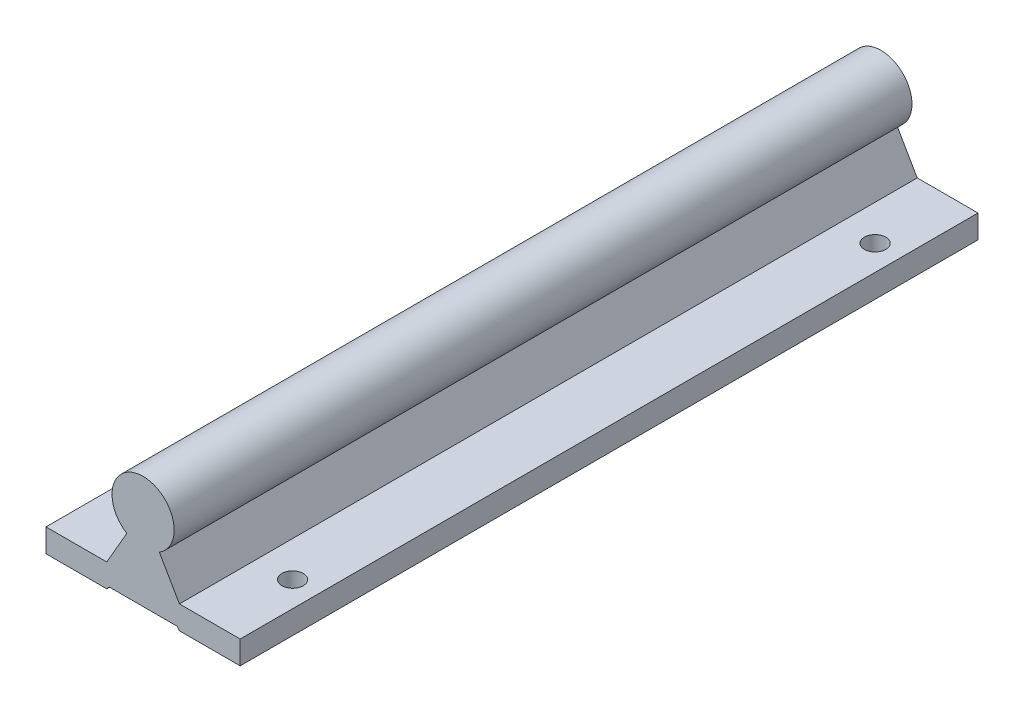
ISO-10303-21;
HEADER;
FILE_DESCRIPTION(('STEP AP214'),'2;1');
FILE_NAME('part.step','',(''),(''),'','','');
FILE_SCHEMA(('AUTOMOTIVE_DESIGN { 1 0 10303 214 1 1 1 1 }'));
ENDSEC;
DATA;
#1=APPLICATION_CONTEXT('core data for automotive mechanical design processes');
#2=APPLICATION_PROTOCOL_DEFINITION('international standard','automotive_design',2000,#1);
#3=PRODUCT_CONTEXT('',#1,'mechanical');
#4=PRODUCT('Part','Part','',(#3));
#5=PRODUCT_RELATED_PRODUCT_CATEGORY('part','',(#4));
#6=PRODUCT_DEFINITION_FORMATION('','',#4);
#7=PRODUCT_DEFINITION_CONTEXT('part definition',#1,'design');
#8=PRODUCT_DEFINITION('design','',#6,#7);
#9=PRODUCT_DEFINITION_SHAPE('','',#8);
#10=(LENGTH_UNIT() NAMED_UNIT(*) SI_UNIT(.MILLI.,.METRE.));
#11=(NAMED_UNIT(*) PLANE_ANGLE_UNIT() SI_UNIT($,.RADIAN.));
#12=(NAMED_UNIT(*) SI_UNIT($,.STERADIAN.) SOLID_ANGLE_UNIT());
#13=UNCERTAINTY_MEASURE_WITH_UNIT(LENGTH_MEASURE(1.E-05),#10,'distance_accuracy_value','');
#14=(GEOMETRIC_REPRESENTATION_CONTEXT(3) GLOBAL_UNCERTAINTY_ASSIGNED_CONTEXT((#13)) GLOBAL_UNIT_ASSIGNED_CONTEXT((#10,
#11,#12)) REPRESENTATION_CONTEXT('',''));
#15=CARTESIAN_POINT('',(0.,0.,0.));
#16=DIRECTION('',(0.,0.,1.));
#17=DIRECTION('',(1.,0.,0.));
#18=AXIS2_PLACEMENT_3D('',#15,#16,#17);
#19=CARTESIAN_POINT('',(0.,-21.7799240871176,190.));
#20=DIRECTION('',(0.,-1.,0.));
#21=DIRECTION('',(0.,0.,-1.));
#22=AXIS2_PLACEMENT_3D('',#19,#20,#21);
#23=PLANE('',#22);
#24=CARTESIAN_POINT('',(18.5,-21.7799240871176,170.));
#25=DIRECTION('',(0.,-1.,0.));
#26=DIRECTION('',(1.,0.,0.));
#27=AXIS2_PLACEMENT_3D('',#24,#25,#26);
#28=CIRCLE('',#27,2.74999999999999);
#29=CARTESIAN_POINT('',(21.25,-21.7799240871176,170.));
#30=VERTEX_POINT('',#29);
#31=EDGE_CURVE('E177',#30,#30,#28,.T.);
#32=ORIENTED_EDGE('',*,*,#31,.F.);
#33=EDGE_LOOP('',(#32));
#34=FACE_BOUND('',#33,.T.);
#35=DIRECTION('',(-1.,0.,0.));
#36=VECTOR('',#35,1.);
#37=CARTESIAN_POINT('',(0.,-21.7799240871176,0.));
#38=LINE('',#37,#36);
#39=CARTESIAN_POINT('',(25.,-21.7799240871176,0.));
#40=VERTEX_POINT('',#39);
#41=CARTESIAN_POINT('',(9.355,-21.7799240871176,0.));
#42=VERTEX_POINT('',#41);
#43=EDGE_CURVE('E229',#40,#42,#38,.T.);
#44=ORIENTED_EDGE('',*,*,#43,.F.);
#45=DIRECTION('',(0.,0.,-1.));
#46=VECTOR('',#45,1.);
#47=CARTESIAN_POINT('',(25.,-21.7799240871176,190.));
#48=LINE('',#47,#46);
#49=CARTESIAN_POINT('',(25.,-21.7799240871176,190.));
#50=VERTEX_POINT('',#49);
#51=EDGE_CURVE('E245',#50,#40,#48,.T.);
#52=ORIENTED_EDGE('',*,*,#51,.F.);
#53=DIRECTION('',(-1.,0.,0.));
#54=VECTOR('',#53,1.);
#55=CARTESIAN_POINT('',(0.,-21.7799240871176,190.));
#56=LINE('',#55,#54);
#57=CARTESIAN_POINT('',(9.355,-21.7799240871176,190.));
#58=VERTEX_POINT('',#57);
#59=EDGE_CURVE('E200',#50,#58,#56,.T.);
#60=ORIENTED_EDGE('',*,*,#59,.T.);
#61=DIRECTION('',(0.,0.,-1.));
#62=VECTOR('',#61,1.);
#63=CARTESIAN_POINT('',(9.355,-21.7799240871176,190.));
#64=LINE('',#63,#62);
#65=EDGE_CURVE('E247',#58,#42,#64,.T.);
#66=ORIENTED_EDGE('',*,*,#65,.T.);
#67=EDGE_LOOP('',(#44,#52,#60,#66));
#68=FACE_BOUND('',#67,.T.);
#69=CARTESIAN_POINT('',(18.5,-21.7799240871176,20.));
#70=DIRECTION('',(0.,-1.,0.));
#71=DIRECTION('',(1.,0.,0.));
#72=AXIS2_PLACEMENT_3D('',#69,#70,#71);
#73=CIRCLE('',#72,2.74999999999998);
#74=CARTESIAN_POINT('',(21.25,-21.7799240871176,20.));
#75=VERTEX_POINT('',#74);
#76=EDGE_CURVE('E158',#75,#75,#73,.T.);
#77=ORIENTED_EDGE('',*,*,#76,.F.);
#78=EDGE_LOOP('',(#77));
#79=FACE_BOUND('',#78,.T.);
#80=ADVANCED_FACE('F39',(#34,#68,#79),#23,.T.);
#81=CARTESIAN_POINT('',(0.,-15.7799240871176,190.));
#82=DIRECTION('',(0.,1.,0.));
#83=DIRECTION('',(0.,0.,1.));
#84=AXIS2_PLACEMENT_3D('',#81,#82,#83);
#85=PLANE('',#84);
#86=CARTESIAN_POINT('',(18.5,-15.7799240871176,170.));
#87=DIRECTION('',(0.,-1.,0.));
#88=DIRECTION('',(1.,0.,0.));
#89=AXIS2_PLACEMENT_3D('',#86,#87,#88);
#90=CIRCLE('',#89,2.74999999999999);
#91=CARTESIAN_POINT('',(21.25,-15.7799240871176,170.));
#92=VERTEX_POINT('',#91);
#93=EDGE_CURVE('E174',#92,#92,#90,.T.);
#94=ORIENTED_EDGE('',*,*,#93,.T.);
#95=EDGE_LOOP('',(#94));
#96=FACE_BOUND('',#95,.T.);
#97=DIRECTION('',(1.,0.,0.));
#98=VECTOR('',#97,1.);
#99=CARTESIAN_POINT('',(0.,-15.7799240871176,0.));
#100=LINE('',#99,#98);
#101=CARTESIAN_POINT('',(9.355,-15.7799240871176,0.));
#102=VERTEX_POINT('',#101);
#103=CARTESIAN_POINT('',(25.,-15.7799240871176,0.));
#104=VERTEX_POINT('',#103);
#105=EDGE_CURVE('E235',#102,#104,#100,.T.);
#106=ORIENTED_EDGE('',*,*,#105,.F.);
#107=DIRECTION('',(0.,0.,-1.));
#108=VECTOR('',#107,1.);
#109=CARTESIAN_POINT('',(9.355,-15.7799240871176,190.));
#110=LINE('',#109,#108);
#111=CARTESIAN_POINT('',(9.355,-15.7799240871176,190.));
#112=VERTEX_POINT('',#111);
#113=EDGE_CURVE('E241',#112,#102,#110,.T.);
#114=ORIENTED_EDGE('',*,*,#113,.F.);
#115=DIRECTION('',(1.,0.,0.));
#116=VECTOR('',#115,1.);
#117=CARTESIAN_POINT('',(0.,-15.7799240871176,190.));
#118=LINE('',#117,#116);
#119=CARTESIAN_POINT('',(25.,-15.7799240871176,190.));
#120=VERTEX_POINT('',#119);
#121=EDGE_CURVE('E206',#112,#120,#118,.T.);
#122=ORIENTED_EDGE('',*,*,#121,.T.);
#123=DIRECTION('',(0.,0.,-1.));
#124=VECTOR('',#123,1.);
#125=CARTESIAN_POINT('',(25.,-15.7799240871176,190.));
#126=LINE('',#125,#124);
#127=EDGE_CURVE('E243',#120,#104,#126,.T.);
#128=ORIENTED_EDGE('',*,*,#127,.T.);
#129=EDGE_LOOP('',(#106,#114,#122,#128));
#130=FACE_BOUND('',#129,.T.);
#131=CARTESIAN_POINT('',(18.5,-15.7799240871176,20.));
#132=DIRECTION('',(0.,-1.,0.));
#133=DIRECTION('',(1.,0.,0.));
#134=AXIS2_PLACEMENT_3D('',#131,#132,#133);
#135=CIRCLE('',#134,2.74999999999998);
#136=CARTESIAN_POINT('',(21.25,-15.7799240871176,20.));
#137=VERTEX_POINT('',#136);
#138=EDGE_CURVE('E159',#137,#137,#135,.T.);
#139=ORIENTED_EDGE('',*,*,#138,.T.);
#140=EDGE_LOOP('',(#139));
#141=FACE_BOUND('',#140,.T.);
#142=ADVANCED_FACE('F291',(#96,#130,#141),#85,.T.);
#143=CARTESIAN_POINT('',(0.,-15.7799240871176,190.));
#144=DIRECTION('',(0.,-1.,0.));
#145=DIRECTION('',(1.,0.,0.));
#146=AXIS2_PLACEMENT_3D('',#143,#144,#145);
#147=PLANE('',#146);
#148=DIRECTION('',(-1.,0.,0.));
#149=VECTOR('',#148,1.);
#150=CARTESIAN_POINT('',(0.,-15.7799240871176,0.));
#151=LINE('',#150,#149);
#152=CARTESIAN_POINT('',(-9.355,-15.7799240871176,0.));
#153=VERTEX_POINT('',#152);
#154=CARTESIAN_POINT('',(-25.,-15.7799240871176,0.));
#155=VERTEX_POINT('',#154);
#156=EDGE_CURVE('E214',#153,#155,#151,.T.);
#157=ORIENTED_EDGE('',*,*,#156,.T.);
#158=DIRECTION('',(0.,0.,-1.));
#159=VECTOR('',#158,1.);
#160=CARTESIAN_POINT('',(-25.,-15.7799240871176,190.));
#161=LINE('',#160,#159);
#162=CARTESIAN_POINT('',(-25.,-15.7799240871176,190.));
#163=VERTEX_POINT('',#162);
#164=EDGE_CURVE('E259',#163,#155,#161,.T.);
#165=ORIENTED_EDGE('',*,*,#164,.F.);
#166=DIRECTION('',(-1.,0.,0.));
#167=VECTOR('',#166,1.);
#168=CARTESIAN_POINT('',(0.,-15.7799240871176,190.));
#169=LINE('',#168,#167);
#170=CARTESIAN_POINT('',(-9.355,-15.7799240871176,190.));
#171=VERTEX_POINT('',#170);
#172=EDGE_CURVE('E185',#171,#163,#169,.T.);
#173=ORIENTED_EDGE('',*,*,#172,.F.);
#174=DIRECTION('',(0.,0.,-1.));
#175=VECTOR('',#174,1.);
#176=CARTESIAN_POINT('',(-9.355,-15.7799240871176,190.));
#177=LINE('',#176,#175);
#178=EDGE_CURVE('E262',#171,#153,#177,.T.);
#179=ORIENTED_EDGE('',*,*,#178,.T.);
#180=EDGE_LOOP('',(#157,#165,#173,#179));
#181=FACE_BOUND('',#180,.T.);
#182=CARTESIAN_POINT('',(-18.5,-15.7799240871176,170.));
#183=DIRECTION('',(0.,1.,0.));
#184=DIRECTION('',(-1.,0.,0.));
#185=AXIS2_PLACEMENT_3D('',#182,#183,#184);
#186=CIRCLE('',#185,2.74999999999999);
#187=CARTESIAN_POINT('',(-21.25,-15.7799240871176,170.));
#188=VERTEX_POINT('',#187);
#189=EDGE_CURVE('E171',#188,#188,#186,.T.);
#190=ORIENTED_EDGE('',*,*,#189,.F.);
#191=EDGE_LOOP('',(#190));
#192=FACE_BOUND('',#191,.T.);
#193=CARTESIAN_POINT('',(-18.5,-15.7799240871176,20.));
#194=DIRECTION('',(0.,-1.,0.));
#195=DIRECTION('',(1.,0.,0.));
#196=AXIS2_PLACEMENT_3D('',#193,#194,#195);
#197=CIRCLE('',#196,2.74999999999998);
#198=CARTESIAN_POINT('',(-15.75,-15.7799240871176,20.));
#199=VERTEX_POINT('',#198);
#200=EDGE_CURVE('E165',#199,#199,#197,.T.);
#201=ORIENTED_EDGE('',*,*,#200,.T.);
#202=EDGE_LOOP('',(#201));
#203=FACE_BOUND('',#202,.T.);
#204=ADVANCED_FACE('F277',(#181,#192,#203),#147,.F.);
#205=CARTESIAN_POINT('',(0.,-21.7799240871176,190.));
#206=DIRECTION('',(0.,1.,0.));
#207=DIRECTION('',(-1.,0.,0.));
#208=AXIS2_PLACEMENT_3D('',#205,#206,#207);
#209=PLANE('',#208);
#210=DIRECTION('',(1.,0.,0.));
#211=VECTOR('',#210,1.);
#212=CARTESIAN_POINT('',(0.,-21.7799240871176,0.));
#213=LINE('',#212,#211);
#214=CARTESIAN_POINT('',(-25.,-21.7799240871176,0.));
#215=VERTEX_POINT('',#214);
#216=CARTESIAN_POINT('',(-9.35499999999999,-21.7799240871176,0.));
#217=VERTEX_POINT('',#216);
#218=EDGE_CURVE('E218',#215,#217,#213,.T.);
#219=ORIENTED_EDGE('',*,*,#218,.T.);
#220=DIRECTION('',(0.,0.,-1.));
#221=VECTOR('',#220,1.);
#222=CARTESIAN_POINT('',(-9.35499999999999,-21.7799240871176,190.));
#223=LINE('',#222,#221);
#224=CARTESIAN_POINT('',(-9.35499999999999,-21.7799240871176,190.));
#225=VERTEX_POINT('',#224);
#226=EDGE_CURVE('E253',#225,#217,#223,.T.);
#227=ORIENTED_EDGE('',*,*,#226,.F.);
#228=DIRECTION('',(1.,0.,0.));
#229=VECTOR('',#228,1.);
#230=CARTESIAN_POINT('',(0.,-21.7799240871176,190.));
#231=LINE('',#230,#229);
#232=CARTESIAN_POINT('',(-25.,-21.7799240871176,190.));
#233=VERTEX_POINT('',#232);
#234=EDGE_CURVE('E190',#233,#225,#231,.T.);
#235=ORIENTED_EDGE('',*,*,#234,.F.);
#236=DIRECTION('',(0.,0.,-1.));
#237=VECTOR('',#236,1.);
#238=CARTESIAN_POINT('',(-25.,-21.7799240871176,190.));
#239=LINE('',#238,#237);
#240=EDGE_CURVE('E256',#233,#215,#239,.T.);
#241=ORIENTED_EDGE('',*,*,#240,.T.);
#242=EDGE_LOOP('',(#219,#227,#235,#241));
#243=FACE_BOUND('',#242,.T.);
#244=CARTESIAN_POINT('',(-18.5,-21.7799240871176,170.));
#245=DIRECTION('',(0.,1.,0.));
#246=DIRECTION('',(-1.,0.,0.));
#247=AXIS2_PLACEMENT_3D('',#244,#245,#246);
#248=CIRCLE('',#247,2.74999999999999);
#249=CARTESIAN_POINT('',(-21.25,-21.7799240871176,170.));
#250=VERTEX_POINT('',#249);
#251=EDGE_CURVE('E168',#250,#250,#248,.T.);
#252=ORIENTED_EDGE('',*,*,#251,.T.);
#253=EDGE_LOOP('',(#252));
#254=FACE_BOUND('',#253,.T.);
#255=CARTESIAN_POINT('',(-18.5,-21.7799240871176,20.));
#256=DIRECTION('',(0.,-1.,0.));
#257=DIRECTION('',(1.,0.,0.));
#258=AXIS2_PLACEMENT_3D('',#255,#256,#257);
#259=CIRCLE('',#258,2.74999999999998);
#260=CARTESIAN_POINT('',(-15.75,-21.7799240871176,20.));
#261=VERTEX_POINT('',#260);
#262=EDGE_CURVE('E162',#261,#261,#259,.T.);
#263=ORIENTED_EDGE('',*,*,#262,.F.);
#264=EDGE_LOOP('',(#263));
#265=FACE_BOUND('',#264,.T.);
#266=ADVANCED_FACE('F317',(#243,#254,#265),#209,.F.);
#267=CARTESIAN_POINT('',(0.,0.,190.));
#268=DIRECTION('',(0.,0.,-1.));
#269=DIRECTION('',(-1.,0.,0.));
#270=AXIS2_PLACEMENT_3D('',#267,#268,#269);
#271=CYLINDRICAL_SURFACE('',#270,8.);
#272=DIRECTION('',(0.,0.,-1.));
#273=VECTOR('',#272,1.);
#274=CARTESIAN_POINT('',(-4.18194158806093,-6.81992408711756,190.));
#275=LINE('',#274,#273);
#276=CARTESIAN_POINT('',(-4.18194158806094,-6.81992408711757,190.));
#277=VERTEX_POINT('',#276);
#278=CARTESIAN_POINT('',(-4.18194158806094,-6.81992408711757,0.));
#279=VERTEX_POINT('',#278);
#280=EDGE_CURVE('E57',#277,#279,#275,.T.);
#281=ORIENTED_EDGE('',*,*,#280,.F.);
#282=CARTESIAN_POINT('',(0.,0.,190.));
#283=DIRECTION('',(0.,0.,1.));
#284=DIRECTION('',(1.,0.,0.));
#285=AXIS2_PLACEMENT_3D('',#282,#283,#284);
#286=CIRCLE('',#285,8.);
#287=CARTESIAN_POINT('',(4.18194158806094,-6.81992408711757,190.));
#288=VERTEX_POINT('',#287);
#289=EDGE_CURVE('E11',#288,#277,#286,.T.);
#290=ORIENTED_EDGE('',*,*,#289,.F.);
#291=DIRECTION('',(0.,0.,-1.));
#292=VECTOR('',#291,1.);
#293=CARTESIAN_POINT('',(4.18194158806094,-6.81992408711757,190.));
#294=LINE('',#293,#292);
#295=CARTESIAN_POINT('',(4.18194158806094,-6.81992408711757,0.));
#296=VERTEX_POINT('',#295);
#297=EDGE_CURVE('E212',#288,#296,#294,.T.);
#298=ORIENTED_EDGE('',*,*,#297,.T.);
#299=CARTESIAN_POINT('',(0.,0.,0.));
#300=DIRECTION('',(0.,0.,1.));
#301=DIRECTION('',(1.,0.,0.));
#302=AXIS2_PLACEMENT_3D('',#299,#300,#301);
#303=CIRCLE('',#302,8.);
#304=EDGE_CURVE('E43',#296,#279,#303,.T.);
#305=ORIENTED_EDGE('',*,*,#304,.T.);
#306=EDGE_LOOP('',(#281,#290,#298,#305));
#307=FACE_BOUND('',#306,.T.);
#308=ADVANCED_FACE('F41',(#307),#271,.T.);
#309=CARTESIAN_POINT('',(0.,0.,190.));
#310=DIRECTION('',(0.,0.,1.));
#311=DIRECTION('',(1.,0.,0.));
#312=AXIS2_PLACEMENT_3D('',#309,#310,#311);
#313=PLANE('',#312);
#314=ORIENTED_EDGE('',*,*,#289,.T.);
#315=DIRECTION('',(-0.500000000000001,-0.866025403784438,0.));
#316=VECTOR('',#315,1.);
#317=CARTESIAN_POINT('',(-0.183342435383084,0.105852804422306,190.));
#318=LINE('',#317,#316);
#319=EDGE_CURVE('E183',#277,#171,#318,.T.);
#320=ORIENTED_EDGE('',*,*,#319,.T.);
#321=ORIENTED_EDGE('',*,*,#172,.T.);
#322=DIRECTION('',(0.,-1.,0.));
#323=VECTOR('',#322,1.);
#324=CARTESIAN_POINT('',(-25.,0.,190.));
#325=LINE('',#324,#323);
#326=EDGE_CURVE('E188',#163,#233,#325,.T.);
#327=ORIENTED_EDGE('',*,*,#326,.T.);
#328=ORIENTED_EDGE('',*,*,#234,.T.);
#329=DIRECTION('',(0.640083504014272,0.768305348080314,0.));
#330=VECTOR('',#329,1.);
#331=CARTESIAN_POINT('',(5.18872988158464,-4.32278704331117,190.));
#332=LINE('',#331,#330);
#333=CARTESIAN_POINT('',(-8.74806735739786,-21.0514103974016,190.));
#334=VERTEX_POINT('',#333);
#335=EDGE_CURVE('E192',#225,#334,#332,.T.);
#336=ORIENTED_EDGE('',*,*,#335,.T.);
#337=DIRECTION('',(-1.,0.,0.));
#338=VECTOR('',#337,1.);
#339=CARTESIAN_POINT('',(0.,-21.0514103974016,190.));
#340=LINE('',#339,#338);
#341=CARTESIAN_POINT('',(8.74806735739786,-21.0514103974016,190.));
#342=VERTEX_POINT('',#341);
#343=EDGE_CURVE('E194',#342,#334,#340,.T.);
#344=ORIENTED_EDGE('',*,*,#343,.F.);
#345=DIRECTION('',(-0.640083504014278,0.768305348080309,0.));
#346=VECTOR('',#345,1.);
#347=CARTESIAN_POINT('',(-5.18872988158474,-4.32278704331132,190.));
#348=LINE('',#347,#346);
#349=EDGE_CURVE('E197',#58,#342,#348,.T.);
#350=ORIENTED_EDGE('',*,*,#349,.F.);
#351=ORIENTED_EDGE('',*,*,#59,.F.);
#352=DIRECTION('',(0.,-1.,0.));
#353=VECTOR('',#352,1.);
#354=CARTESIAN_POINT('',(25.,0.,190.));
#355=LINE('',#354,#353);
#356=EDGE_CURVE('E203',#120,#50,#355,.T.);
#357=ORIENTED_EDGE('',*,*,#356,.F.);
#358=ORIENTED_EDGE('',*,*,#121,.F.);
#359=DIRECTION('',(0.500000000000001,-0.866025403784438,0.));
#360=VECTOR('',#359,1.);
#361=CARTESIAN_POINT('',(0.183342435383088,0.105852804422308,190.));
#362=LINE('',#361,#360);
#363=EDGE_CURVE('E209',#288,#112,#362,.T.);
#364=ORIENTED_EDGE('',*,*,#363,.F.);
#365=EDGE_LOOP('',(#314,#320,#321,#327,#328,#336,#344,#350,#351,#357,#358,#364));
#366=FACE_BOUND('',#365,.T.);
#367=ADVANCED_FACE('F282',(#366),#313,.T.);
#368=CARTESIAN_POINT('',(0.,0.,0.));
#369=DIRECTION('',(0.,0.,1.));
#370=DIRECTION('',(1.,0.,0.));
#371=AXIS2_PLACEMENT_3D('',#368,#369,#370);
#372=PLANE('',#371);
#373=ORIENTED_EDGE('',*,*,#304,.F.);
#374=DIRECTION('',(0.500000000000001,-0.866025403784438,0.));
#375=VECTOR('',#374,1.);
#376=CARTESIAN_POINT('',(0.183342435383088,0.105852804422308,0.));
#377=LINE('',#376,#375);
#378=EDGE_CURVE('E186',#296,#102,#377,.T.);
#379=ORIENTED_EDGE('',*,*,#378,.T.);
#380=ORIENTED_EDGE('',*,*,#105,.T.);
#381=DIRECTION('',(0.,-1.,0.));
#382=VECTOR('',#381,1.);
#383=CARTESIAN_POINT('',(25.,0.,0.));
#384=LINE('',#383,#382);
#385=EDGE_CURVE('E232',#104,#40,#384,.T.);
#386=ORIENTED_EDGE('',*,*,#385,.T.);
#387=ORIENTED_EDGE('',*,*,#43,.T.);
#388=DIRECTION('',(-0.640083504014278,0.768305348080309,0.));
#389=VECTOR('',#388,1.);
#390=CARTESIAN_POINT('',(-5.18872988158474,-4.32278704331132,0.));
#391=LINE('',#390,#389);
#392=CARTESIAN_POINT('',(8.74806735739786,-21.0514103974016,0.));
#393=VERTEX_POINT('',#392);
#394=EDGE_CURVE('E226',#42,#393,#391,.T.);
#395=ORIENTED_EDGE('',*,*,#394,.T.);
#396=DIRECTION('',(-1.,0.,0.));
#397=VECTOR('',#396,1.);
#398=CARTESIAN_POINT('',(0.,-21.0514103974016,0.));
#399=LINE('',#398,#397);
#400=CARTESIAN_POINT('',(-8.74806735739786,-21.0514103974016,0.));
#401=VERTEX_POINT('',#400);
#402=EDGE_CURVE('E223',#393,#401,#399,.T.);
#403=ORIENTED_EDGE('',*,*,#402,.T.);
#404=DIRECTION('',(0.640083504014272,0.768305348080314,0.));
#405=VECTOR('',#404,1.);
#406=CARTESIAN_POINT('',(5.18872988158464,-4.32278704331117,0.));
#407=LINE('',#406,#405);
#408=EDGE_CURVE('E220',#217,#401,#407,.T.);
#409=ORIENTED_EDGE('',*,*,#408,.F.);
#410=ORIENTED_EDGE('',*,*,#218,.F.);
#411=DIRECTION('',(0.,-1.,0.));
#412=VECTOR('',#411,1.);
#413=CARTESIAN_POINT('',(-25.,0.,0.));
#414=LINE('',#413,#412);
#415=EDGE_CURVE('E216',#155,#215,#414,.T.);
#416=ORIENTED_EDGE('',*,*,#415,.F.);
#417=ORIENTED_EDGE('',*,*,#156,.F.);
#418=DIRECTION('',(-0.500000000000001,-0.866025403784438,0.));
#419=VECTOR('',#418,1.);
#420=CARTESIAN_POINT('',(-0.183342435383084,0.105852804422306,0.));
#421=LINE('',#420,#419);
#422=EDGE_CURVE('E180',#279,#153,#421,.T.);
#423=ORIENTED_EDGE('',*,*,#422,.F.);
#424=EDGE_LOOP('',(#373,#379,#380,#386,#387,#395,#403,#409,#410,#416,#417,#423));
#425=FACE_BOUND('',#424,.T.);
#426=ADVANCED_FACE('F270',(#425),#372,.F.);
#427=CARTESIAN_POINT('',(-0.183342435383084,0.105852804422306,190.));
#428=DIRECTION('',(0.866025403784438,-0.500000000000001,0.));
#429=DIRECTION('',(0.500000000000001,0.866025403784438,0.));
#430=AXIS2_PLACEMENT_3D('',#427,#428,#429);
#431=PLANE('',#430);
#432=ORIENTED_EDGE('',*,*,#422,.T.);
#433=ORIENTED_EDGE('',*,*,#178,.F.);
#434=ORIENTED_EDGE('',*,*,#319,.F.);
#435=ORIENTED_EDGE('',*,*,#280,.T.);
#436=EDGE_LOOP('',(#432,#433,#434,#435));
#437=FACE_BOUND('',#436,.T.);
#438=ADVANCED_FACE('F274',(#437),#431,.F.);
#439=CARTESIAN_POINT('',(-25.,0.,190.));
#440=DIRECTION('',(1.,0.,0.));
#441=DIRECTION('',(0.,1.,0.));
#442=AXIS2_PLACEMENT_3D('',#439,#440,#441);
#443=PLANE('',#442);
#444=ORIENTED_EDGE('',*,*,#415,.T.);
#445=ORIENTED_EDGE('',*,*,#240,.F.);
#446=ORIENTED_EDGE('',*,*,#326,.F.);
#447=ORIENTED_EDGE('',*,*,#164,.T.);
#448=EDGE_LOOP('',(#444,#445,#446,#447));
#449=FACE_BOUND('',#448,.T.);
#450=ADVANCED_FACE('F320',(#449),#443,.F.);
#451=CARTESIAN_POINT('',(5.18872988158464,-4.32278704331117,190.));
#452=DIRECTION('',(-0.768305348080314,0.640083504014272,0.));
#453=DIRECTION('',(-0.640083504014272,-0.768305348080314,0.));
#454=AXIS2_PLACEMENT_3D('',#451,#452,#453);
#455=PLANE('',#454);
#456=ORIENTED_EDGE('',*,*,#408,.T.);
#457=DIRECTION('',(0.,0.,-1.));
#458=VECTOR('',#457,1.);
#459=CARTESIAN_POINT('',(-8.74806735739786,-21.0514103974016,190.));
#460=LINE('',#459,#458);
#461=EDGE_CURVE('E251',#334,#401,#460,.T.);
#462=ORIENTED_EDGE('',*,*,#461,.F.);
#463=ORIENTED_EDGE('',*,*,#335,.F.);
#464=ORIENTED_EDGE('',*,*,#226,.T.);
#465=EDGE_LOOP('',(#456,#462,#463,#464));
#466=FACE_BOUND('',#465,.T.);
#467=ADVANCED_FACE('F313',(#466),#455,.F.);
#468=CARTESIAN_POINT('',(0.,-21.0514103974016,190.));
#469=DIRECTION('',(0.,-1.,0.));
#470=DIRECTION('',(0.,0.,-1.));
#471=AXIS2_PLACEMENT_3D('',#468,#469,#470);
#472=PLANE('',#471);
#473=CARTESIAN_POINT('',(0.,-21.0514103974016,20.));
#474=DIRECTION('',(0.,-1.,0.));
#475=DIRECTION('',(0.,0.,-1.));
#476=AXIS2_PLACEMENT_3D('',#473,#474,#475);
#477=CIRCLE('',#476,5.);
#478=CARTESIAN_POINT('',(0.,-21.0514103974016,15.));
#479=VERTEX_POINT('',#478);
#480=EDGE_CURVE('E541',#479,#479,#477,.T.);
#481=ORIENTED_EDGE('',*,*,#480,.F.);
#482=EDGE_LOOP('',(#481));
#483=FACE_BOUND('',#482,.T.);
#484=CARTESIAN_POINT('',(0.,-21.0514103974016,170.));
#485=DIRECTION('',(0.,-1.,0.));
#486=DIRECTION('',(0.,0.,-1.));
#487=AXIS2_PLACEMENT_3D('',#484,#485,#486);
#488=CIRCLE('',#487,5.);
#489=CARTESIAN_POINT('',(0.,-21.0514103974016,165.));
#490=VERTEX_POINT('',#489);
#491=EDGE_CURVE('E139',#490,#490,#488,.T.);
#492=ORIENTED_EDGE('',*,*,#491,.F.);
#493=EDGE_LOOP('',(#492));
#494=FACE_BOUND('',#493,.T.);
#495=ORIENTED_EDGE('',*,*,#402,.F.);
#496=DIRECTION('',(0.,0.,-1.));
#497=VECTOR('',#496,1.);
#498=CARTESIAN_POINT('',(8.74806735739786,-21.0514103974016,190.));
#499=LINE('',#498,#497);
#500=EDGE_CURVE('E249',#342,#393,#499,.T.);
#501=ORIENTED_EDGE('',*,*,#500,.F.);
#502=ORIENTED_EDGE('',*,*,#343,.T.);
#503=ORIENTED_EDGE('',*,*,#461,.T.);
#504=EDGE_LOOP('',(#495,#501,#502,#503));
#505=FACE_BOUND('',#504,.T.);
#506=ADVANCED_FACE('F308',(#483,#494,#505),#472,.T.);
#507=CARTESIAN_POINT('',(-5.18872988158474,-4.32278704331132,190.));
#508=DIRECTION('',(-0.768305348080309,-0.640083504014278,0.));
#509=DIRECTION('',(0.640083504014278,-0.768305348080309,0.));
#510=AXIS2_PLACEMENT_3D('',#507,#508,#509);
#511=PLANE('',#510);
#512=ORIENTED_EDGE('',*,*,#394,.F.);
#513=ORIENTED_EDGE('',*,*,#65,.F.);
#514=ORIENTED_EDGE('',*,*,#349,.T.);
#515=ORIENTED_EDGE('',*,*,#500,.T.);
#516=EDGE_LOOP('',(#512,#513,#514,#515));
#517=FACE_BOUND('',#516,.T.);
#518=ADVANCED_FACE('F303',(#517),#511,.T.);
#519=CARTESIAN_POINT('',(25.,0.,190.));
#520=DIRECTION('',(1.,0.,0.));
#521=DIRECTION('',(0.,1.,0.));
#522=AXIS2_PLACEMENT_3D('',#519,#520,#521);
#523=PLANE('',#522);
#524=ORIENTED_EDGE('',*,*,#385,.F.);
#525=ORIENTED_EDGE('',*,*,#127,.F.);
#526=ORIENTED_EDGE('',*,*,#356,.T.);
#527=ORIENTED_EDGE('',*,*,#51,.T.);
#528=EDGE_LOOP('',(#524,#525,#526,#527));
#529=FACE_BOUND('',#528,.T.);
#530=ADVANCED_FACE('F296',(#529),#523,.T.);
#531=CARTESIAN_POINT('',(0.183342435383088,0.105852804422308,190.));
#532=DIRECTION('',(0.866025403784438,0.500000000000001,0.));
#533=DIRECTION('',(-0.500000000000001,0.866025403784438,0.));
#534=AXIS2_PLACEMENT_3D('',#531,#532,#533);
#535=PLANE('',#534);
#536=ORIENTED_EDGE('',*,*,#378,.F.);
#537=ORIENTED_EDGE('',*,*,#297,.F.);
#538=ORIENTED_EDGE('',*,*,#363,.T.);
#539=ORIENTED_EDGE('',*,*,#113,.T.);
#540=EDGE_LOOP('',(#536,#537,#538,#539));
#541=FACE_BOUND('',#540,.T.);
#542=ADVANCED_FACE('F288',(#541),#535,.T.);
#543=CARTESIAN_POINT('',(18.5,-21.7799240871176,170.));
#544=DIRECTION('',(0.,1.,0.));
#545=DIRECTION('',(-1.,0.,0.));
#546=AXIS2_PLACEMENT_3D('',#543,#544,#545);
#547=CYLINDRICAL_SURFACE('',#546,2.74999999999999);
#548=ORIENTED_EDGE('',*,*,#31,.T.);
#549=EDGE_LOOP('',(#548));
#550=FACE_BOUND('',#549,.T.);
#551=ORIENTED_EDGE('',*,*,#93,.F.);
#552=EDGE_LOOP('',(#551));
#553=FACE_BOUND('',#552,.T.);
#554=ADVANCED_FACE('F396',(#550,#553),#547,.F.);
#555=CARTESIAN_POINT('',(-18.5,-21.7799240871176,170.));
#556=DIRECTION('',(0.,1.,0.));
#557=DIRECTION('',(-1.,0.,0.));
#558=AXIS2_PLACEMENT_3D('',#555,#556,#557);
#559=CYLINDRICAL_SURFACE('',#558,2.74999999999999);
#560=ORIENTED_EDGE('',*,*,#251,.F.);
#561=EDGE_LOOP('',(#560));
#562=FACE_BOUND('',#561,.T.);
#563=ORIENTED_EDGE('',*,*,#189,.T.);
#564=EDGE_LOOP('',(#563));
#565=FACE_BOUND('',#564,.T.);
#566=ADVANCED_FACE('F424',(#562,#565),#559,.F.);
#567=CARTESIAN_POINT('',(-18.5,-21.7799240871176,20.));
#568=DIRECTION('',(0.,1.,0.));
#569=DIRECTION('',(-1.,0.,0.));
#570=AXIS2_PLACEMENT_3D('',#567,#568,#569);
#571=CYLINDRICAL_SURFACE('',#570,2.74999999999998);
#572=ORIENTED_EDGE('',*,*,#262,.T.);
#573=EDGE_LOOP('',(#572));
#574=FACE_BOUND('',#573,.T.);
#575=ORIENTED_EDGE('',*,*,#200,.F.);
#576=EDGE_LOOP('',(#575));
#577=FACE_BOUND('',#576,.T.);
#578=ADVANCED_FACE('F434',(#574,#577),#571,.F.);
#579=CARTESIAN_POINT('',(18.5,-21.7799240871176,20.));
#580=DIRECTION('',(0.,1.,0.));
#581=DIRECTION('',(-1.,0.,0.));
#582=AXIS2_PLACEMENT_3D('',#579,#580,#581);
#583=CYLINDRICAL_SURFACE('',#582,2.74999999999998);
#584=ORIENTED_EDGE('',*,*,#76,.T.);
#585=EDGE_LOOP('',(#584));
#586=FACE_BOUND('',#585,.T.);
#587=ORIENTED_EDGE('',*,*,#138,.F.);
#588=EDGE_LOOP('',(#587));
#589=FACE_BOUND('',#588,.T.);
#590=ADVANCED_FACE('F444',(#586,#589),#583,.F.);
#591=CARTESIAN_POINT('',(0.,-3.05141039740164,170.));
#592=DIRECTION('',(0.,-1.,0.));
#593=DIRECTION('',(0.,0.,-1.));
#594=AXIS2_PLACEMENT_3D('',#591,#592,#593);
#595=CONICAL_SURFACE('',#594,2.65,1.02974425867665);
#596=CARTESIAN_POINT('',(0.,-1.4591297569786,170.));
#597=VERTEX_POINT('',#596);
#598=VERTEX_LOOP('',#597);
#599=FACE_BOUND('',#598,.T.);
#600=CARTESIAN_POINT('',(0.,-3.05141039740164,170.));
#601=DIRECTION('',(0.,-1.,0.));
#602=DIRECTION('',(0.,0.,-1.));
#603=AXIS2_PLACEMENT_3D('',#600,#601,#602);
#604=CIRCLE('',#603,2.65);
#605=CARTESIAN_POINT('',(0.,-3.05141039740164,167.35));
#606=VERTEX_POINT('',#605);
#607=EDGE_CURVE('E155',#606,#606,#604,.T.);
#608=ORIENTED_EDGE('',*,*,#607,.T.);
#609=EDGE_LOOP('',(#608));
#610=FACE_BOUND('',#609,.T.);
#611=ADVANCED_FACE('F454',(#599,#610),#595,.F.);
#612=CARTESIAN_POINT('',(0.,-21.0514103974016,170.));
#613=DIRECTION('',(0.,-1.,0.));
#614=DIRECTION('',(0.,0.,-1.));
#615=AXIS2_PLACEMENT_3D('',#612,#613,#614);
#616=CYLINDRICAL_SURFACE('',#615,2.65);
#617=ORIENTED_EDGE('',*,*,#607,.F.);
#618=EDGE_LOOP('',(#617));
#619=FACE_BOUND('',#618,.T.);
#620=CARTESIAN_POINT('',(0.,-16.0514103974016,170.));
#621=DIRECTION('',(0.,-1.,0.));
#622=DIRECTION('',(0.,0.,-1.));
#623=AXIS2_PLACEMENT_3D('',#620,#621,#622);
#624=CIRCLE('',#623,2.65);
#625=CARTESIAN_POINT('',(0.,-16.0514103974016,167.35));
#626=VERTEX_POINT('',#625);
#627=EDGE_CURVE('E152',#626,#626,#624,.T.);
#628=ORIENTED_EDGE('',*,*,#627,.T.);
#629=EDGE_LOOP('',(#628));
#630=FACE_BOUND('',#629,.T.);
#631=ADVANCED_FACE('F469',(#619,#630),#616,.F.);
#632=CARTESIAN_POINT('',(2.65,-16.0514103974016,170.));
#633=DIRECTION('',(0.,1.,0.));
#634=DIRECTION('',(0.,0.,1.));
#635=AXIS2_PLACEMENT_3D('',#632,#633,#634);
#636=PLANE('',#635);
#637=ORIENTED_EDGE('',*,*,#627,.F.);
#638=EDGE_LOOP('',(#637));
#639=FACE_BOUND('',#638,.T.);
#640=CARTESIAN_POINT('',(0.,-16.0514103974016,170.));
#641=DIRECTION('',(0.,-1.,0.));
#642=DIRECTION('',(0.,0.,-1.));
#643=AXIS2_PLACEMENT_3D('',#640,#641,#642);
#644=CIRCLE('',#643,5.);
#645=CARTESIAN_POINT('',(0.,-16.0514103974016,165.));
#646=VERTEX_POINT('',#645);
#647=EDGE_CURVE('E143',#646,#646,#644,.T.);
#648=ORIENTED_EDGE('',*,*,#647,.T.);
#649=EDGE_LOOP('',(#648));
#650=FACE_BOUND('',#649,.T.);
#651=ADVANCED_FACE('F479',(#639,#650),#636,.F.);
#652=CARTESIAN_POINT('',(0.,-21.0514103974016,170.));
#653=DIRECTION('',(0.,-1.,0.));
#654=DIRECTION('',(0.,0.,-1.));
#655=AXIS2_PLACEMENT_3D('',#652,#653,#654);
#656=CYLINDRICAL_SURFACE('',#655,5.);
#657=ORIENTED_EDGE('',*,*,#647,.F.);
#658=EDGE_LOOP('',(#657));
#659=FACE_BOUND('',#658,.T.);
#660=ORIENTED_EDGE('',*,*,#491,.T.);
#661=EDGE_LOOP('',(#660));
#662=FACE_BOUND('',#661,.T.);
#663=ADVANCED_FACE('F133',(#659,#662),#656,.F.);
#664=CARTESIAN_POINT('',(0.,-3.05141039740164,20.));
#665=DIRECTION('',(0.,-1.,0.));
#666=DIRECTION('',(0.,0.,-1.));
#667=AXIS2_PLACEMENT_3D('',#664,#665,#666);
#668=CONICAL_SURFACE('',#667,2.65,1.02974425867665);
#669=CARTESIAN_POINT('',(0.,-1.4591297569786,20.));
#670=VERTEX_POINT('',#669);
#671=VERTEX_LOOP('',#670);
#672=FACE_BOUND('',#671,.T.);
#673=CARTESIAN_POINT('',(0.,-3.05141039740164,20.));
#674=DIRECTION('',(0.,-1.,0.));
#675=DIRECTION('',(0.,0.,-1.));
#676=AXIS2_PLACEMENT_3D('',#673,#674,#675);
#677=CIRCLE('',#676,2.65);
#678=CARTESIAN_POINT('',(0.,-3.05141039740164,17.35));
#679=VERTEX_POINT('',#678);
#680=EDGE_CURVE('E137',#679,#679,#677,.T.);
#681=ORIENTED_EDGE('',*,*,#680,.T.);
#682=EDGE_LOOP('',(#681));
#683=FACE_BOUND('',#682,.T.);
#684=ADVANCED_FACE('F129',(#672,#683),#668,.F.);
#685=CARTESIAN_POINT('',(0.,-21.0514103974016,20.));
#686=DIRECTION('',(0.,-1.,0.));
#687=DIRECTION('',(0.,0.,-1.));
#688=AXIS2_PLACEMENT_3D('',#685,#686,#687);
#689=CYLINDRICAL_SURFACE('',#688,2.65);
#690=ORIENTED_EDGE('',*,*,#680,.F.);
#691=EDGE_LOOP('',(#690));
#692=FACE_BOUND('',#691,.T.);
#693=CARTESIAN_POINT('',(0.,-16.0514103974016,20.));
#694=DIRECTION('',(0.,-1.,0.));
#695=DIRECTION('',(0.,0.,-1.));
#696=AXIS2_PLACEMENT_3D('',#693,#694,#695);
#697=CIRCLE('',#696,2.65);
#698=CARTESIAN_POINT('',(0.,-16.0514103974016,17.35));
#699=VERTEX_POINT('',#698);
#700=EDGE_CURVE('E140',#699,#699,#697,.T.);
#701=ORIENTED_EDGE('',*,*,#700,.T.);
#702=EDGE_LOOP('',(#701));
#703=FACE_BOUND('',#702,.T.);
#704=ADVANCED_FACE('F132',(#692,#703),#689,.F.);
#705=CARTESIAN_POINT('',(2.65,-16.0514103974016,20.));
#706=DIRECTION('',(0.,1.,0.));
#707=DIRECTION('',(0.,0.,1.));
#708=AXIS2_PLACEMENT_3D('',#705,#706,#707);
#709=PLANE('',#708);
#710=ORIENTED_EDGE('',*,*,#700,.F.);
#711=EDGE_LOOP('',(#710));
#712=FACE_BOUND('',#711,.T.);
#713=CARTESIAN_POINT('',(0.,-16.0514103974016,20.));
#714=DIRECTION('',(0.,-1.,0.));
#715=DIRECTION('',(0.,0.,-1.));
#716=AXIS2_PLACEMENT_3D('',#713,#714,#715);
#717=CIRCLE('',#716,5.);
#718=CARTESIAN_POINT('',(0.,-16.0514103974016,15.));
#719=VERTEX_POINT('',#718);
#720=EDGE_CURVE('E146',#719,#719,#717,.T.);
#721=ORIENTED_EDGE('',*,*,#720,.T.);
#722=EDGE_LOOP('',(#721));
#723=FACE_BOUND('',#722,.T.);
#724=ADVANCED_FACE('F513',(#712,#723),#709,.F.);
#725=CARTESIAN_POINT('',(0.,-21.0514103974016,20.));
#726=DIRECTION('',(0.,-1.,0.));
#727=DIRECTION('',(0.,0.,-1.));
#728=AXIS2_PLACEMENT_3D('',#725,#726,#727);
#729=CYLINDRICAL_SURFACE('',#728,5.);
#730=ORIENTED_EDGE('',*,*,#720,.F.);
#731=EDGE_LOOP('',(#730));
#732=FACE_BOUND('',#731,.T.);
#733=ORIENTED_EDGE('',*,*,#480,.T.);
#734=EDGE_LOOP('',(#733));
#735=FACE_BOUND('',#734,.T.);
#736=ADVANCED_FACE('F522',(#732,#735),#729,.F.);
#737=CLOSED_SHELL('',(#80,#142,#204,#266,#308,#367,#426,#438,#450,#467,#506,#518,#530,#542,#554,
#566,#578,#590,#611,#631,#651,#663,#684,#704,#724,#736));
#738=MANIFOLD_SOLID_BREP('B2',#737);
#739=ADVANCED_BREP_SHAPE_REPRESENTATION('',(#18,#738),#14);
#740=SHAPE_DEFINITION_REPRESENTATION(#9,#739);
ENDSEC;
END-ISO-10303-21;
